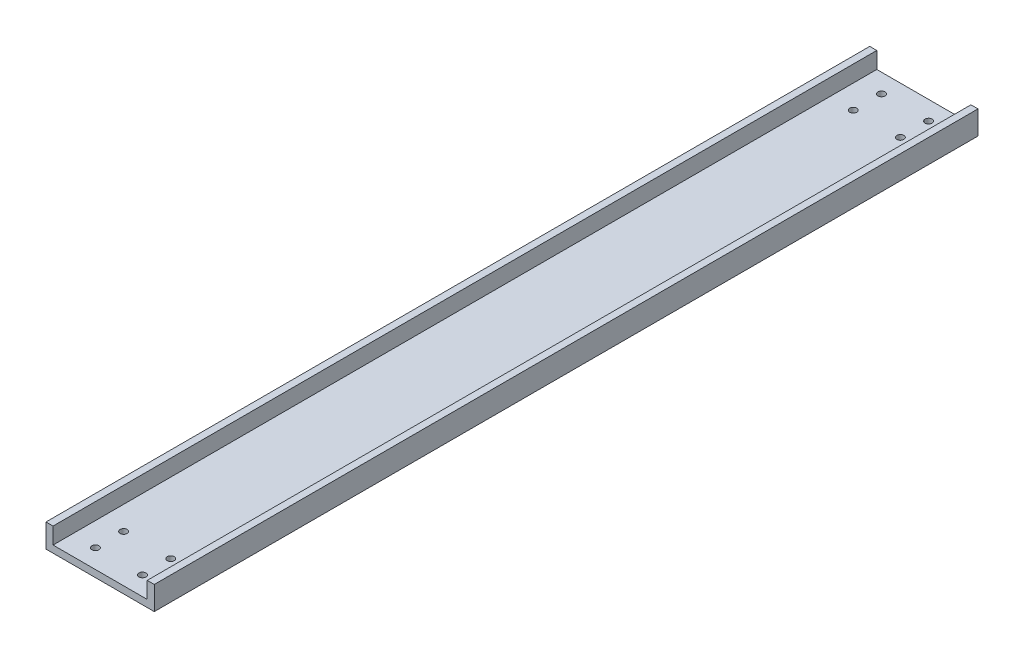
ISO-10303-21;
HEADER;
FILE_DESCRIPTION(('STEP AP214'),'2;1');
FILE_NAME('part.step','',(''),(''),'','','');
FILE_SCHEMA(('AUTOMOTIVE_DESIGN { 1 0 10303 214 1 1 1 1 }'));
ENDSEC;
DATA;
#1=APPLICATION_CONTEXT('core data for automotive mechanical design processes');
#2=APPLICATION_PROTOCOL_DEFINITION('international standard','automotive_design',2000,#1);
#3=PRODUCT_CONTEXT('',#1,'mechanical');
#4=PRODUCT('Part','Part','',(#3));
#5=PRODUCT_RELATED_PRODUCT_CATEGORY('part','',(#4));
#6=PRODUCT_DEFINITION_FORMATION('','',#4);
#7=PRODUCT_DEFINITION_CONTEXT('part definition',#1,'design');
#8=PRODUCT_DEFINITION('design','',#6,#7);
#9=PRODUCT_DEFINITION_SHAPE('','',#8);
#10=(LENGTH_UNIT() NAMED_UNIT(*) SI_UNIT(.MILLI.,.METRE.));
#11=(NAMED_UNIT(*) PLANE_ANGLE_UNIT() SI_UNIT($,.RADIAN.));
#12=(NAMED_UNIT(*) SI_UNIT($,.STERADIAN.) SOLID_ANGLE_UNIT());
#13=UNCERTAINTY_MEASURE_WITH_UNIT(LENGTH_MEASURE(1.E-05),#10,'distance_accuracy_value','');
#14=(GEOMETRIC_REPRESENTATION_CONTEXT(3) GLOBAL_UNCERTAINTY_ASSIGNED_CONTEXT((#13)) GLOBAL_UNIT_ASSIGNED_CONTEXT((#10,
#11,#12)) REPRESENTATION_CONTEXT('',''));
#15=CARTESIAN_POINT('',(0.,0.,0.));
#16=DIRECTION('',(0.,0.,1.));
#17=DIRECTION('',(1.,0.,0.));
#18=AXIS2_PLACEMENT_3D('',#15,#16,#17);
#19=CARTESIAN_POINT('',(40.,0.,350.));
#20=DIRECTION('',(0.,-1.,0.));
#21=DIRECTION('',(0.,0.,-1.));
#22=AXIS2_PLACEMENT_3D('',#19,#20,#21);
#23=PLANE('',#22);
#24=CARTESIAN_POINT('',(10.,0.,8.00000000000001));
#25=DIRECTION('',(0.,-1.,0.));
#26=DIRECTION('',(0.,0.,-1.));
#27=AXIS2_PLACEMENT_3D('',#24,#25,#26);
#28=CIRCLE('',#27,1.49999999999999);
#29=CARTESIAN_POINT('',(10.,0.,6.50000000000002));
#30=VERTEX_POINT('',#29);
#31=EDGE_CURVE('E216',#30,#30,#28,.T.);
#32=ORIENTED_EDGE('',*,*,#31,.T.);
#33=EDGE_LOOP('',(#32));
#34=FACE_BOUND('',#33,.T.);
#35=CARTESIAN_POINT('',(30.,0.,8.00000000000001));
#36=DIRECTION('',(0.,-1.,0.));
#37=DIRECTION('',(0.,0.,-1.));
#38=AXIS2_PLACEMENT_3D('',#35,#36,#37);
#39=CIRCLE('',#38,1.49999999999999);
#40=CARTESIAN_POINT('',(30.,0.,6.50000000000002));
#41=VERTEX_POINT('',#40);
#42=EDGE_CURVE('E210',#41,#41,#39,.T.);
#43=ORIENTED_EDGE('',*,*,#42,.T.);
#44=EDGE_LOOP('',(#43));
#45=FACE_BOUND('',#44,.T.);
#46=CARTESIAN_POINT('',(30.,0.,20.));
#47=DIRECTION('',(0.,-1.,0.));
#48=DIRECTION('',(0.,0.,-1.));
#49=AXIS2_PLACEMENT_3D('',#46,#47,#48);
#50=CIRCLE('',#49,1.49999999999999);
#51=CARTESIAN_POINT('',(30.,0.,18.5));
#52=VERTEX_POINT('',#51);
#53=EDGE_CURVE('E204',#52,#52,#50,.T.);
#54=ORIENTED_EDGE('',*,*,#53,.T.);
#55=EDGE_LOOP('',(#54));
#56=FACE_BOUND('',#55,.T.);
#57=CARTESIAN_POINT('',(10.,0.,20.));
#58=DIRECTION('',(0.,-1.,0.));
#59=DIRECTION('',(0.,0.,-1.));
#60=AXIS2_PLACEMENT_3D('',#57,#58,#59);
#61=CIRCLE('',#60,1.49999999999999);
#62=CARTESIAN_POINT('',(10.,0.,18.5));
#63=VERTEX_POINT('',#62);
#64=EDGE_CURVE('E198',#63,#63,#61,.T.);
#65=ORIENTED_EDGE('',*,*,#64,.T.);
#66=EDGE_LOOP('',(#65));
#67=FACE_BOUND('',#66,.T.);
#68=CARTESIAN_POINT('',(10.,0.,342.));
#69=DIRECTION('',(0.,-1.,0.));
#70=DIRECTION('',(0.,0.,-1.));
#71=AXIS2_PLACEMENT_3D('',#68,#69,#70);
#72=CIRCLE('',#71,1.49999999999999);
#73=CARTESIAN_POINT('',(10.,0.,340.5));
#74=VERTEX_POINT('',#73);
#75=EDGE_CURVE('E192',#74,#74,#72,.T.);
#76=ORIENTED_EDGE('',*,*,#75,.T.);
#77=EDGE_LOOP('',(#76));
#78=FACE_BOUND('',#77,.T.);
#79=CARTESIAN_POINT('',(30.,0.,342.));
#80=DIRECTION('',(0.,-1.,0.));
#81=DIRECTION('',(0.,0.,-1.));
#82=AXIS2_PLACEMENT_3D('',#79,#80,#81);
#83=CIRCLE('',#82,1.49999999999999);
#84=CARTESIAN_POINT('',(30.,0.,340.5));
#85=VERTEX_POINT('',#84);
#86=EDGE_CURVE('E35',#85,#85,#83,.T.);
#87=ORIENTED_EDGE('',*,*,#86,.T.);
#88=EDGE_LOOP('',(#87));
#89=FACE_BOUND('',#88,.T.);
#90=CARTESIAN_POINT('',(30.,0.,330.));
#91=DIRECTION('',(0.,-1.,0.));
#92=DIRECTION('',(0.,0.,-1.));
#93=AXIS2_PLACEMENT_3D('',#90,#91,#92);
#94=CIRCLE('',#93,1.49999999999999);
#95=CARTESIAN_POINT('',(30.,0.,328.5));
#96=VERTEX_POINT('',#95);
#97=EDGE_CURVE('E183',#96,#96,#94,.T.);
#98=ORIENTED_EDGE('',*,*,#97,.T.);
#99=EDGE_LOOP('',(#98));
#100=FACE_BOUND('',#99,.T.);
#101=CARTESIAN_POINT('',(10.,0.,330.));
#102=DIRECTION('',(0.,-1.,0.));
#103=DIRECTION('',(0.,0.,-1.));
#104=AXIS2_PLACEMENT_3D('',#101,#102,#103);
#105=CIRCLE('',#104,1.49999999999999);
#106=CARTESIAN_POINT('',(10.,0.,328.5));
#107=VERTEX_POINT('',#106);
#108=EDGE_CURVE('E133',#107,#107,#105,.T.);
#109=ORIENTED_EDGE('',*,*,#108,.T.);
#110=EDGE_LOOP('',(#109));
#111=FACE_BOUND('',#110,.T.);
#112=DIRECTION('',(-1.,0.,0.));
#113=VECTOR('',#112,1.);
#114=CARTESIAN_POINT('',(40.,0.,0.));
#115=LINE('',#114,#113);
#116=CARTESIAN_POINT('',(40.,0.,0.));
#117=VERTEX_POINT('',#116);
#118=CARTESIAN_POINT('',(0.,0.,0.));
#119=VERTEX_POINT('',#118);
#120=EDGE_CURVE('E129',#117,#119,#115,.T.);
#121=ORIENTED_EDGE('',*,*,#120,.T.);
#122=DIRECTION('',(0.,0.,-1.));
#123=VECTOR('',#122,1.);
#124=CARTESIAN_POINT('',(0.,0.,350.));
#125=LINE('',#124,#123);
#126=CARTESIAN_POINT('',(0.,0.,350.));
#127=VERTEX_POINT('',#126);
#128=EDGE_CURVE('E11',#127,#119,#125,.T.);
#129=ORIENTED_EDGE('',*,*,#128,.F.);
#130=DIRECTION('',(-1.,0.,0.));
#131=VECTOR('',#130,1.);
#132=CARTESIAN_POINT('',(40.,0.,350.));
#133=LINE('',#132,#131);
#134=CARTESIAN_POINT('',(40.,0.,350.));
#135=VERTEX_POINT('',#134);
#136=EDGE_CURVE('E144',#135,#127,#133,.T.);
#137=ORIENTED_EDGE('',*,*,#136,.F.);
#138=DIRECTION('',(0.,0.,-1.));
#139=VECTOR('',#138,1.);
#140=CARTESIAN_POINT('',(40.,0.,350.));
#141=LINE('',#140,#139);
#142=EDGE_CURVE('E125',#135,#117,#141,.T.);
#143=ORIENTED_EDGE('',*,*,#142,.T.);
#144=EDGE_LOOP('',(#121,#129,#137,#143));
#145=FACE_BOUND('',#144,.T.);
#146=ADVANCED_FACE('F32',(#34,#45,#56,#67,#78,#89,#100,#111,#145),#23,.F.);
#147=CARTESIAN_POINT('',(0.,0.,350.));
#148=DIRECTION('',(-1.,0.,0.));
#149=DIRECTION('',(0.,0.,1.));
#150=AXIS2_PLACEMENT_3D('',#147,#148,#149);
#151=PLANE('',#150);
#152=DIRECTION('',(0.,1.,0.));
#153=VECTOR('',#152,1.);
#154=CARTESIAN_POINT('',(0.,0.,0.));
#155=LINE('',#154,#153);
#156=CARTESIAN_POINT('',(0.,6.99999999999999,0.));
#157=VERTEX_POINT('',#156);
#158=EDGE_CURVE('E132',#119,#157,#155,.T.);
#159=ORIENTED_EDGE('',*,*,#158,.T.);
#160=DIRECTION('',(0.,0.,-1.));
#161=VECTOR('',#160,1.);
#162=CARTESIAN_POINT('',(0.,6.99999999999999,350.));
#163=LINE('',#162,#161);
#164=CARTESIAN_POINT('',(0.,6.99999999999999,350.));
#165=VERTEX_POINT('',#164);
#166=EDGE_CURVE('E41',#165,#157,#163,.T.);
#167=ORIENTED_EDGE('',*,*,#166,.F.);
#168=DIRECTION('',(0.,1.,0.));
#169=VECTOR('',#168,1.);
#170=CARTESIAN_POINT('',(0.,0.,350.));
#171=LINE('',#170,#169);
#172=EDGE_CURVE('E92',#127,#165,#171,.T.);
#173=ORIENTED_EDGE('',*,*,#172,.F.);
#174=ORIENTED_EDGE('',*,*,#128,.T.);
#175=EDGE_LOOP('',(#159,#167,#173,#174));
#176=FACE_BOUND('',#175,.T.);
#177=ADVANCED_FACE('F252',(#176),#151,.F.);
#178=CARTESIAN_POINT('',(0.,6.99999999999999,350.));
#179=DIRECTION('',(0.,-1.,0.));
#180=DIRECTION('',(0.,0.,-1.));
#181=AXIS2_PLACEMENT_3D('',#178,#179,#180);
#182=PLANE('',#181);
#183=DIRECTION('',(-1.,0.,0.));
#184=VECTOR('',#183,1.);
#185=CARTESIAN_POINT('',(0.,6.99999999999999,0.));
#186=LINE('',#185,#184);
#187=CARTESIAN_POINT('',(-3.,6.99999999999999,0.));
#188=VERTEX_POINT('',#187);
#189=EDGE_CURVE('E135',#157,#188,#186,.T.);
#190=ORIENTED_EDGE('',*,*,#189,.T.);
#191=DIRECTION('',(0.,0.,-1.));
#192=VECTOR('',#191,1.);
#193=CARTESIAN_POINT('',(-3.,6.99999999999999,350.));
#194=LINE('',#193,#192);
#195=CARTESIAN_POINT('',(-3.,6.99999999999999,350.));
#196=VERTEX_POINT('',#195);
#197=EDGE_CURVE('E151',#196,#188,#194,.T.);
#198=ORIENTED_EDGE('',*,*,#197,.F.);
#199=DIRECTION('',(-1.,0.,0.));
#200=VECTOR('',#199,1.);
#201=CARTESIAN_POINT('',(0.,6.99999999999999,350.));
#202=LINE('',#201,#200);
#203=EDGE_CURVE('E160',#165,#196,#202,.T.);
#204=ORIENTED_EDGE('',*,*,#203,.F.);
#205=ORIENTED_EDGE('',*,*,#166,.T.);
#206=EDGE_LOOP('',(#190,#198,#204,#205));
#207=FACE_BOUND('',#206,.T.);
#208=ADVANCED_FACE('F158',(#207),#182,.F.);
#209=CARTESIAN_POINT('',(-3.,6.99999999999999,350.));
#210=DIRECTION('',(1.,0.,0.));
#211=DIRECTION('',(0.,1.,0.));
#212=AXIS2_PLACEMENT_3D('',#209,#210,#211);
#213=PLANE('',#212);
#214=DIRECTION('',(0.,-1.,0.));
#215=VECTOR('',#214,1.);
#216=CARTESIAN_POINT('',(-3.,6.99999999999999,0.));
#217=LINE('',#216,#215);
#218=CARTESIAN_POINT('',(-3.,-3.,0.));
#219=VERTEX_POINT('',#218);
#220=EDGE_CURVE('E137',#188,#219,#217,.T.);
#221=ORIENTED_EDGE('',*,*,#220,.T.);
#222=DIRECTION('',(0.,0.,-1.));
#223=VECTOR('',#222,1.);
#224=CARTESIAN_POINT('',(-3.,-3.,350.));
#225=LINE('',#224,#223);
#226=CARTESIAN_POINT('',(-3.,-3.,350.));
#227=VERTEX_POINT('',#226);
#228=EDGE_CURVE('E148',#227,#219,#225,.T.);
#229=ORIENTED_EDGE('',*,*,#228,.F.);
#230=DIRECTION('',(0.,-1.,0.));
#231=VECTOR('',#230,1.);
#232=CARTESIAN_POINT('',(-3.,6.99999999999999,350.));
#233=LINE('',#232,#231);
#234=EDGE_CURVE('E172',#196,#227,#233,.T.);
#235=ORIENTED_EDGE('',*,*,#234,.F.);
#236=ORIENTED_EDGE('',*,*,#197,.T.);
#237=EDGE_LOOP('',(#221,#229,#235,#236));
#238=FACE_BOUND('',#237,.T.);
#239=ADVANCED_FACE('F168',(#238),#213,.F.);
#240=CARTESIAN_POINT('',(-3.,-3.,350.));
#241=DIRECTION('',(0.,1.,0.));
#242=DIRECTION('',(-1.,0.,0.));
#243=AXIS2_PLACEMENT_3D('',#240,#241,#242);
#244=PLANE('',#243);
#245=CARTESIAN_POINT('',(10.,-3.,8.00000000000001));
#246=DIRECTION('',(0.,-1.,0.));
#247=DIRECTION('',(0.,0.,-1.));
#248=AXIS2_PLACEMENT_3D('',#245,#246,#247);
#249=CIRCLE('',#248,1.49999999999999);
#250=CARTESIAN_POINT('',(10.,-3.,6.50000000000002));
#251=VERTEX_POINT('',#250);
#252=EDGE_CURVE('E219',#251,#251,#249,.T.);
#253=ORIENTED_EDGE('',*,*,#252,.F.);
#254=EDGE_LOOP('',(#253));
#255=FACE_BOUND('',#254,.T.);
#256=CARTESIAN_POINT('',(30.,-3.,8.00000000000001));
#257=DIRECTION('',(0.,-1.,0.));
#258=DIRECTION('',(0.,0.,-1.));
#259=AXIS2_PLACEMENT_3D('',#256,#257,#258);
#260=CIRCLE('',#259,1.49999999999999);
#261=CARTESIAN_POINT('',(30.,-3.,6.50000000000002));
#262=VERTEX_POINT('',#261);
#263=EDGE_CURVE('E213',#262,#262,#260,.T.);
#264=ORIENTED_EDGE('',*,*,#263,.F.);
#265=EDGE_LOOP('',(#264));
#266=FACE_BOUND('',#265,.T.);
#267=CARTESIAN_POINT('',(30.,-3.,20.));
#268=DIRECTION('',(0.,-1.,0.));
#269=DIRECTION('',(0.,0.,-1.));
#270=AXIS2_PLACEMENT_3D('',#267,#268,#269);
#271=CIRCLE('',#270,1.49999999999999);
#272=CARTESIAN_POINT('',(30.,-3.,18.5));
#273=VERTEX_POINT('',#272);
#274=EDGE_CURVE('E207',#273,#273,#271,.T.);
#275=ORIENTED_EDGE('',*,*,#274,.F.);
#276=EDGE_LOOP('',(#275));
#277=FACE_BOUND('',#276,.T.);
#278=CARTESIAN_POINT('',(10.,-3.,20.));
#279=DIRECTION('',(0.,-1.,0.));
#280=DIRECTION('',(0.,0.,-1.));
#281=AXIS2_PLACEMENT_3D('',#278,#279,#280);
#282=CIRCLE('',#281,1.49999999999999);
#283=CARTESIAN_POINT('',(10.,-3.,18.5));
#284=VERTEX_POINT('',#283);
#285=EDGE_CURVE('E201',#284,#284,#282,.T.);
#286=ORIENTED_EDGE('',*,*,#285,.F.);
#287=EDGE_LOOP('',(#286));
#288=FACE_BOUND('',#287,.T.);
#289=CARTESIAN_POINT('',(10.,-3.,342.));
#290=DIRECTION('',(0.,-1.,0.));
#291=DIRECTION('',(0.,0.,-1.));
#292=AXIS2_PLACEMENT_3D('',#289,#290,#291);
#293=CIRCLE('',#292,1.49999999999999);
#294=CARTESIAN_POINT('',(10.,-3.,340.5));
#295=VERTEX_POINT('',#294);
#296=EDGE_CURVE('E195',#295,#295,#293,.T.);
#297=ORIENTED_EDGE('',*,*,#296,.F.);
#298=EDGE_LOOP('',(#297));
#299=FACE_BOUND('',#298,.T.);
#300=CARTESIAN_POINT('',(30.,-3.,342.));
#301=DIRECTION('',(0.,-1.,0.));
#302=DIRECTION('',(0.,0.,-1.));
#303=AXIS2_PLACEMENT_3D('',#300,#301,#302);
#304=CIRCLE('',#303,1.49999999999999);
#305=CARTESIAN_POINT('',(30.,-3.,340.5));
#306=VERTEX_POINT('',#305);
#307=EDGE_CURVE('E189',#306,#306,#304,.T.);
#308=ORIENTED_EDGE('',*,*,#307,.F.);
#309=EDGE_LOOP('',(#308));
#310=FACE_BOUND('',#309,.T.);
#311=CARTESIAN_POINT('',(30.,-3.,330.));
#312=DIRECTION('',(0.,-1.,0.));
#313=DIRECTION('',(0.,0.,-1.));
#314=AXIS2_PLACEMENT_3D('',#311,#312,#313);
#315=CIRCLE('',#314,1.49999999999999);
#316=CARTESIAN_POINT('',(30.,-3.,328.5));
#317=VERTEX_POINT('',#316);
#318=EDGE_CURVE('E186',#317,#317,#315,.T.);
#319=ORIENTED_EDGE('',*,*,#318,.F.);
#320=EDGE_LOOP('',(#319));
#321=FACE_BOUND('',#320,.T.);
#322=CARTESIAN_POINT('',(10.,-3.,330.));
#323=DIRECTION('',(0.,-1.,0.));
#324=DIRECTION('',(0.,0.,-1.));
#325=AXIS2_PLACEMENT_3D('',#322,#323,#324);
#326=CIRCLE('',#325,1.49999999999999);
#327=CARTESIAN_POINT('',(10.,-3.,328.5));
#328=VERTEX_POINT('',#327);
#329=EDGE_CURVE('E180',#328,#328,#326,.T.);
#330=ORIENTED_EDGE('',*,*,#329,.F.);
#331=EDGE_LOOP('',(#330));
#332=FACE_BOUND('',#331,.T.);
#333=DIRECTION('',(1.,0.,0.));
#334=VECTOR('',#333,1.);
#335=CARTESIAN_POINT('',(-3.,-3.,0.));
#336=LINE('',#335,#334);
#337=CARTESIAN_POINT('',(43.,-3.,0.));
#338=VERTEX_POINT('',#337);
#339=EDGE_CURVE('E139',#219,#338,#336,.T.);
#340=ORIENTED_EDGE('',*,*,#339,.T.);
#341=DIRECTION('',(0.,0.,-1.));
#342=VECTOR('',#341,1.);
#343=CARTESIAN_POINT('',(43.,-3.,350.));
#344=LINE('',#343,#342);
#345=CARTESIAN_POINT('',(43.,-3.,350.));
#346=VERTEX_POINT('',#345);
#347=EDGE_CURVE('E120',#346,#338,#344,.T.);
#348=ORIENTED_EDGE('',*,*,#347,.F.);
#349=DIRECTION('',(1.,0.,0.));
#350=VECTOR('',#349,1.);
#351=CARTESIAN_POINT('',(-3.,-3.,350.));
#352=LINE('',#351,#350);
#353=EDGE_CURVE('E111',#227,#346,#352,.T.);
#354=ORIENTED_EDGE('',*,*,#353,.F.);
#355=ORIENTED_EDGE('',*,*,#228,.T.);
#356=EDGE_LOOP('',(#340,#348,#354,#355));
#357=FACE_BOUND('',#356,.T.);
#358=ADVANCED_FACE('F171',(#255,#266,#277,#288,#299,#310,#321,#332,#357),#244,.F.);
#359=CARTESIAN_POINT('',(43.,-3.,350.));
#360=DIRECTION('',(-1.,0.,0.));
#361=DIRECTION('',(0.,0.,1.));
#362=AXIS2_PLACEMENT_3D('',#359,#360,#361);
#363=PLANE('',#362);
#364=DIRECTION('',(0.,1.,0.));
#365=VECTOR('',#364,1.);
#366=CARTESIAN_POINT('',(43.,-3.,0.));
#367=LINE('',#366,#365);
#368=CARTESIAN_POINT('',(43.,6.99999999999999,0.));
#369=VERTEX_POINT('',#368);
#370=EDGE_CURVE('E119',#338,#369,#367,.T.);
#371=ORIENTED_EDGE('',*,*,#370,.T.);
#372=DIRECTION('',(0.,0.,-1.));
#373=VECTOR('',#372,1.);
#374=CARTESIAN_POINT('',(43.,6.99999999999999,350.));
#375=LINE('',#374,#373);
#376=CARTESIAN_POINT('',(43.,6.99999999999999,350.));
#377=VERTEX_POINT('',#376);
#378=EDGE_CURVE('E116',#377,#369,#375,.T.);
#379=ORIENTED_EDGE('',*,*,#378,.F.);
#380=DIRECTION('',(0.,1.,0.));
#381=VECTOR('',#380,1.);
#382=CARTESIAN_POINT('',(43.,-3.,350.));
#383=LINE('',#382,#381);
#384=EDGE_CURVE('E105',#346,#377,#383,.T.);
#385=ORIENTED_EDGE('',*,*,#384,.F.);
#386=ORIENTED_EDGE('',*,*,#347,.T.);
#387=EDGE_LOOP('',(#371,#379,#385,#386));
#388=FACE_BOUND('',#387,.T.);
#389=ADVANCED_FACE('F117',(#388),#363,.F.);
#390=CARTESIAN_POINT('',(43.,6.99999999999999,350.));
#391=DIRECTION('',(0.,-1.,0.));
#392=DIRECTION('',(0.,0.,-1.));
#393=AXIS2_PLACEMENT_3D('',#390,#391,#392);
#394=PLANE('',#393);
#395=DIRECTION('',(-1.,0.,0.));
#396=VECTOR('',#395,1.);
#397=CARTESIAN_POINT('',(43.,6.99999999999999,0.));
#398=LINE('',#397,#396);
#399=CARTESIAN_POINT('',(40.,6.99999999999999,0.));
#400=VERTEX_POINT('',#399);
#401=EDGE_CURVE('E78',#369,#400,#398,.T.);
#402=ORIENTED_EDGE('',*,*,#401,.T.);
#403=DIRECTION('',(0.,0.,-1.));
#404=VECTOR('',#403,1.);
#405=CARTESIAN_POINT('',(40.,6.99999999999999,350.));
#406=LINE('',#405,#404);
#407=CARTESIAN_POINT('',(40.,6.99999999999999,350.));
#408=VERTEX_POINT('',#407);
#409=EDGE_CURVE('E121',#408,#400,#406,.T.);
#410=ORIENTED_EDGE('',*,*,#409,.F.);
#411=DIRECTION('',(-1.,0.,0.));
#412=VECTOR('',#411,1.);
#413=CARTESIAN_POINT('',(43.,6.99999999999999,350.));
#414=LINE('',#413,#412);
#415=EDGE_CURVE('E109',#377,#408,#414,.T.);
#416=ORIENTED_EDGE('',*,*,#415,.F.);
#417=ORIENTED_EDGE('',*,*,#378,.T.);
#418=EDGE_LOOP('',(#402,#410,#416,#417));
#419=FACE_BOUND('',#418,.T.);
#420=ADVANCED_FACE('F123',(#419),#394,.F.);
#421=CARTESIAN_POINT('',(40.,6.99999999999999,350.));
#422=DIRECTION('',(1.,0.,0.));
#423=DIRECTION('',(0.,0.,-1.));
#424=AXIS2_PLACEMENT_3D('',#421,#422,#423);
#425=PLANE('',#424);
#426=DIRECTION('',(0.,-1.,0.));
#427=VECTOR('',#426,1.);
#428=CARTESIAN_POINT('',(40.,6.99999999999999,0.));
#429=LINE('',#428,#427);
#430=EDGE_CURVE('E84',#400,#117,#429,.T.);
#431=ORIENTED_EDGE('',*,*,#430,.T.);
#432=ORIENTED_EDGE('',*,*,#142,.F.);
#433=DIRECTION('',(0.,-1.,0.));
#434=VECTOR('',#433,1.);
#435=CARTESIAN_POINT('',(40.,6.99999999999999,350.));
#436=LINE('',#435,#434);
#437=EDGE_CURVE('E49',#408,#135,#436,.T.);
#438=ORIENTED_EDGE('',*,*,#437,.F.);
#439=ORIENTED_EDGE('',*,*,#409,.T.);
#440=EDGE_LOOP('',(#431,#432,#438,#439));
#441=FACE_BOUND('',#440,.T.);
#442=ADVANCED_FACE('F256',(#441),#425,.F.);
#443=CARTESIAN_POINT('',(0.,0.,350.));
#444=DIRECTION('',(0.,0.,-1.));
#445=DIRECTION('',(-1.,0.,0.));
#446=AXIS2_PLACEMENT_3D('',#443,#444,#445);
#447=PLANE('',#446);
#448=ORIENTED_EDGE('',*,*,#136,.T.);
#449=ORIENTED_EDGE('',*,*,#172,.T.);
#450=ORIENTED_EDGE('',*,*,#203,.T.);
#451=ORIENTED_EDGE('',*,*,#234,.T.);
#452=ORIENTED_EDGE('',*,*,#353,.T.);
#453=ORIENTED_EDGE('',*,*,#384,.T.);
#454=ORIENTED_EDGE('',*,*,#415,.T.);
#455=ORIENTED_EDGE('',*,*,#437,.T.);
#456=EDGE_LOOP('',(#448,#449,#450,#451,#452,#453,#454,#455));
#457=FACE_BOUND('',#456,.T.);
#458=ADVANCED_FACE('F107',(#457),#447,.F.);
#459=CARTESIAN_POINT('',(0.,0.,0.));
#460=DIRECTION('',(0.,0.,-1.));
#461=DIRECTION('',(-1.,0.,0.));
#462=AXIS2_PLACEMENT_3D('',#459,#460,#461);
#463=PLANE('',#462);
#464=ORIENTED_EDGE('',*,*,#120,.F.);
#465=ORIENTED_EDGE('',*,*,#430,.F.);
#466=ORIENTED_EDGE('',*,*,#401,.F.);
#467=ORIENTED_EDGE('',*,*,#370,.F.);
#468=ORIENTED_EDGE('',*,*,#339,.F.);
#469=ORIENTED_EDGE('',*,*,#220,.F.);
#470=ORIENTED_EDGE('',*,*,#189,.F.);
#471=ORIENTED_EDGE('',*,*,#158,.F.);
#472=EDGE_LOOP('',(#464,#465,#466,#467,#468,#469,#470,#471));
#473=FACE_BOUND('',#472,.T.);
#474=ADVANCED_FACE('F164',(#473),#463,.T.);
#475=CARTESIAN_POINT('',(10.,-3.,330.));
#476=DIRECTION('',(0.,-1.,0.));
#477=DIRECTION('',(0.,0.,-1.));
#478=AXIS2_PLACEMENT_3D('',#475,#476,#477);
#479=CYLINDRICAL_SURFACE('',#478,1.49999999999999);
#480=ORIENTED_EDGE('',*,*,#329,.T.);
#481=EDGE_LOOP('',(#480));
#482=FACE_BOUND('',#481,.T.);
#483=ORIENTED_EDGE('',*,*,#108,.F.);
#484=EDGE_LOOP('',(#483));
#485=FACE_BOUND('',#484,.T.);
#486=ADVANCED_FACE('F243',(#482,#485),#479,.F.);
#487=CARTESIAN_POINT('',(30.,-3.,330.));
#488=DIRECTION('',(0.,-1.,0.));
#489=DIRECTION('',(0.,0.,-1.));
#490=AXIS2_PLACEMENT_3D('',#487,#488,#489);
#491=CYLINDRICAL_SURFACE('',#490,1.49999999999999);
#492=ORIENTED_EDGE('',*,*,#318,.T.);
#493=EDGE_LOOP('',(#492));
#494=FACE_BOUND('',#493,.T.);
#495=ORIENTED_EDGE('',*,*,#97,.F.);
#496=EDGE_LOOP('',(#495));
#497=FACE_BOUND('',#496,.T.);
#498=ADVANCED_FACE('F246',(#494,#497),#491,.F.);
#499=CARTESIAN_POINT('',(30.,-3.,342.));
#500=DIRECTION('',(0.,-1.,0.));
#501=DIRECTION('',(0.,0.,-1.));
#502=AXIS2_PLACEMENT_3D('',#499,#500,#501);
#503=CYLINDRICAL_SURFACE('',#502,1.49999999999999);
#504=ORIENTED_EDGE('',*,*,#307,.T.);
#505=EDGE_LOOP('',(#504));
#506=FACE_BOUND('',#505,.T.);
#507=ORIENTED_EDGE('',*,*,#86,.F.);
#508=EDGE_LOOP('',(#507));
#509=FACE_BOUND('',#508,.T.);
#510=ADVANCED_FACE('F330',(#506,#509),#503,.F.);
#511=CARTESIAN_POINT('',(10.,-3.,342.));
#512=DIRECTION('',(0.,-1.,0.));
#513=DIRECTION('',(0.,0.,-1.));
#514=AXIS2_PLACEMENT_3D('',#511,#512,#513);
#515=CYLINDRICAL_SURFACE('',#514,1.49999999999999);
#516=ORIENTED_EDGE('',*,*,#296,.T.);
#517=EDGE_LOOP('',(#516));
#518=FACE_BOUND('',#517,.T.);
#519=ORIENTED_EDGE('',*,*,#75,.F.);
#520=EDGE_LOOP('',(#519));
#521=FACE_BOUND('',#520,.T.);
#522=ADVANCED_FACE('F340',(#518,#521),#515,.F.);
#523=CARTESIAN_POINT('',(10.,-3.,20.));
#524=DIRECTION('',(0.,-1.,0.));
#525=DIRECTION('',(0.,0.,-1.));
#526=AXIS2_PLACEMENT_3D('',#523,#524,#525);
#527=CYLINDRICAL_SURFACE('',#526,1.49999999999999);
#528=ORIENTED_EDGE('',*,*,#285,.T.);
#529=EDGE_LOOP('',(#528));
#530=FACE_BOUND('',#529,.T.);
#531=ORIENTED_EDGE('',*,*,#64,.F.);
#532=EDGE_LOOP('',(#531));
#533=FACE_BOUND('',#532,.T.);
#534=ADVANCED_FACE('F349',(#530,#533),#527,.F.);
#535=CARTESIAN_POINT('',(30.,-3.,20.));
#536=DIRECTION('',(0.,-1.,0.));
#537=DIRECTION('',(0.,0.,-1.));
#538=AXIS2_PLACEMENT_3D('',#535,#536,#537);
#539=CYLINDRICAL_SURFACE('',#538,1.49999999999999);
#540=ORIENTED_EDGE('',*,*,#274,.T.);
#541=EDGE_LOOP('',(#540));
#542=FACE_BOUND('',#541,.T.);
#543=ORIENTED_EDGE('',*,*,#53,.F.);
#544=EDGE_LOOP('',(#543));
#545=FACE_BOUND('',#544,.T.);
#546=ADVANCED_FACE('F373',(#542,#545),#539,.F.);
#547=CARTESIAN_POINT('',(30.,-3.,8.00000000000001));
#548=DIRECTION('',(0.,-1.,0.));
#549=DIRECTION('',(0.,0.,-1.));
#550=AXIS2_PLACEMENT_3D('',#547,#548,#549);
#551=CYLINDRICAL_SURFACE('',#550,1.49999999999999);
#552=ORIENTED_EDGE('',*,*,#263,.T.);
#553=EDGE_LOOP('',(#552));
#554=FACE_BOUND('',#553,.T.);
#555=ORIENTED_EDGE('',*,*,#42,.F.);
#556=EDGE_LOOP('',(#555));
#557=FACE_BOUND('',#556,.T.);
#558=ADVANCED_FACE('F380',(#554,#557),#551,.F.);
#559=CARTESIAN_POINT('',(10.,-3.,8.00000000000001));
#560=DIRECTION('',(0.,-1.,0.));
#561=DIRECTION('',(0.,0.,-1.));
#562=AXIS2_PLACEMENT_3D('',#559,#560,#561);
#563=CYLINDRICAL_SURFACE('',#562,1.49999999999999);
#564=ORIENTED_EDGE('',*,*,#252,.T.);
#565=EDGE_LOOP('',(#564));
#566=FACE_BOUND('',#565,.T.);
#567=ORIENTED_EDGE('',*,*,#31,.F.);
#568=EDGE_LOOP('',(#567));
#569=FACE_BOUND('',#568,.T.);
#570=ADVANCED_FACE('F223',(#566,#569),#563,.F.);
#571=CLOSED_SHELL('',(#146,#177,#208,#239,#358,#389,#420,#442,#458,#474,#486,#498,#510,#522,
#534,#546,#558,#570));
#572=MANIFOLD_SOLID_BREP('B2',#571);
#573=ADVANCED_BREP_SHAPE_REPRESENTATION('',(#18,#572),#14);
#574=SHAPE_DEFINITION_REPRESENTATION(#9,#573);
ENDSEC;
END-ISO-10303-21;
